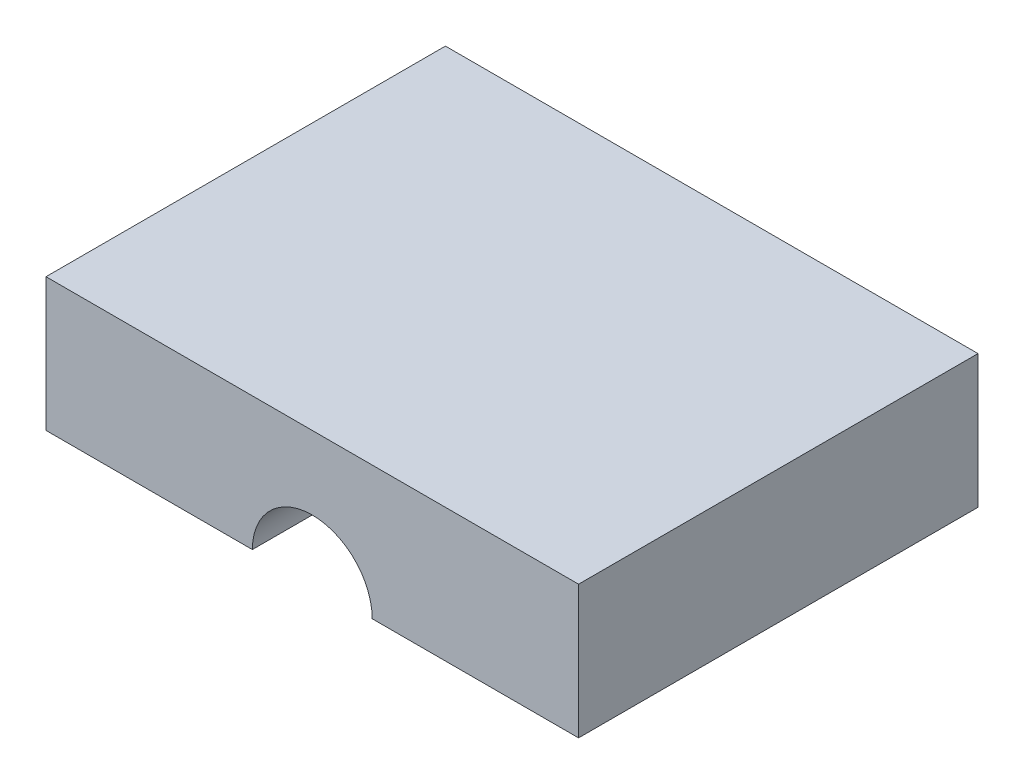
ISO-10303-21;
HEADER;
FILE_DESCRIPTION(('STEP AP214'),'2;1');
FILE_NAME('part.step','',(''),(''),'','','');
FILE_SCHEMA(('AUTOMOTIVE_DESIGN { 1 0 10303 214 1 1 1 1 }'));
ENDSEC;
DATA;
#1=APPLICATION_CONTEXT('core data for automotive mechanical design processes');
#2=APPLICATION_PROTOCOL_DEFINITION('international standard','automotive_design',2000,#1);
#3=PRODUCT_CONTEXT('',#1,'mechanical');
#4=PRODUCT('Part','Part','',(#3));
#5=PRODUCT_RELATED_PRODUCT_CATEGORY('part','',(#4));
#6=PRODUCT_DEFINITION_FORMATION('','',#4);
#7=PRODUCT_DEFINITION_CONTEXT('part definition',#1,'design');
#8=PRODUCT_DEFINITION('design','',#6,#7);
#9=PRODUCT_DEFINITION_SHAPE('','',#8);
#10=(LENGTH_UNIT() NAMED_UNIT(*) SI_UNIT(.MILLI.,.METRE.));
#11=(NAMED_UNIT(*) PLANE_ANGLE_UNIT() SI_UNIT($,.RADIAN.));
#12=(NAMED_UNIT(*) SI_UNIT($,.STERADIAN.) SOLID_ANGLE_UNIT());
#13=UNCERTAINTY_MEASURE_WITH_UNIT(LENGTH_MEASURE(1.E-05),#10,'distance_accuracy_value','');
#14=(GEOMETRIC_REPRESENTATION_CONTEXT(3) GLOBAL_UNCERTAINTY_ASSIGNED_CONTEXT((#13)) GLOBAL_UNIT_ASSIGNED_CONTEXT((#10,
#11,#12)) REPRESENTATION_CONTEXT('',''));
#15=CARTESIAN_POINT('',(0.,0.,0.));
#16=DIRECTION('',(0.,0.,1.));
#17=DIRECTION('',(1.,0.,0.));
#18=AXIS2_PLACEMENT_3D('',#15,#16,#17);
#19=CARTESIAN_POINT('',(0.,0.,0.));
#20=DIRECTION('',(0.,0.,1.));
#21=DIRECTION('',(1.,0.,0.));
#22=AXIS2_PLACEMENT_3D('',#19,#20,#21);
#23=PLANE('',#22);
#24=DIRECTION('',(0.,1.,0.));
#25=VECTOR('',#24,1.);
#26=CARTESIAN_POINT('',(-30.,-15.,0.));
#27=LINE('',#26,#25);
#28=CARTESIAN_POINT('',(-30.,-15.,0.));
#29=VERTEX_POINT('',#28);
#30=CARTESIAN_POINT('',(-30.,-5.00000000000003,0.));
#31=VERTEX_POINT('',#30);
#32=EDGE_CURVE('E111',#29,#31,#27,.T.);
#33=ORIENTED_EDGE('',*,*,#32,.T.);
#34=DIRECTION('',(-1.,0.,0.));
#35=VECTOR('',#34,1.);
#36=CARTESIAN_POINT('',(10.,-5.00000000000003,0.));
#37=LINE('',#36,#35);
#38=CARTESIAN_POINT('',(10.,-5.00000000000003,0.));
#39=VERTEX_POINT('',#38);
#40=EDGE_CURVE('E94',#39,#31,#37,.T.);
#41=ORIENTED_EDGE('',*,*,#40,.F.);
#42=DIRECTION('',(0.,1.,0.));
#43=VECTOR('',#42,1.);
#44=CARTESIAN_POINT('',(10.,-15.,0.));
#45=LINE('',#44,#43);
#46=CARTESIAN_POINT('',(10.,-15.,0.));
#47=VERTEX_POINT('',#46);
#48=EDGE_CURVE('E107',#47,#39,#45,.T.);
#49=ORIENTED_EDGE('',*,*,#48,.F.);
#50=DIRECTION('',(1.,0.,0.));
#51=VECTOR('',#50,1.);
#52=CARTESIAN_POINT('',(10.,-15.,0.));
#53=LINE('',#52,#51);
#54=CARTESIAN_POINT('',(-5.5,-15.,0.));
#55=VERTEX_POINT('',#54);
#56=EDGE_CURVE('E60',#55,#47,#53,.T.);
#57=ORIENTED_EDGE('',*,*,#56,.F.);
#58=CARTESIAN_POINT('',(-10.,-15.,0.));
#59=DIRECTION('',(0.,0.,-1.));
#60=DIRECTION('',(-1.,0.,0.));
#61=AXIS2_PLACEMENT_3D('',#58,#59,#60);
#62=CIRCLE('',#61,4.5);
#63=CARTESIAN_POINT('',(-14.5,-15.,0.));
#64=VERTEX_POINT('',#63);
#65=EDGE_CURVE('E53',#64,#55,#62,.T.);
#66=ORIENTED_EDGE('',*,*,#65,.F.);
#67=EDGE_CURVE('E117',#29,#64,#53,.T.);
#68=ORIENTED_EDGE('',*,*,#67,.F.);
#69=EDGE_LOOP('',(#33,#41,#49,#57,#66,#68));
#70=FACE_BOUND('',#69,.T.);
#71=ADVANCED_FACE('F39',(#70),#23,.F.);
#72=CARTESIAN_POINT('',(10.,-15.,30.));
#73=DIRECTION('',(0.,0.,-1.));
#74=DIRECTION('',(-1.,0.,0.));
#75=AXIS2_PLACEMENT_3D('',#72,#73,#74);
#76=PLANE('',#75);
#77=DIRECTION('',(0.,1.,0.));
#78=VECTOR('',#77,1.);
#79=CARTESIAN_POINT('',(10.,-15.,30.));
#80=LINE('',#79,#78);
#81=CARTESIAN_POINT('',(10.,-15.,30.));
#82=VERTEX_POINT('',#81);
#83=CARTESIAN_POINT('',(10.,-5.00000000000003,30.));
#84=VERTEX_POINT('',#83);
#85=EDGE_CURVE('E130',#82,#84,#80,.T.);
#86=ORIENTED_EDGE('',*,*,#85,.T.);
#87=DIRECTION('',(-1.,0.,0.));
#88=VECTOR('',#87,1.);
#89=CARTESIAN_POINT('',(10.,-5.00000000000004,30.));
#90=LINE('',#89,#88);
#91=CARTESIAN_POINT('',(-30.,-5.00000000000003,30.));
#92=VERTEX_POINT('',#91);
#93=EDGE_CURVE('E97',#84,#92,#90,.T.);
#94=ORIENTED_EDGE('',*,*,#93,.T.);
#95=DIRECTION('',(0.,1.,0.));
#96=VECTOR('',#95,1.);
#97=CARTESIAN_POINT('',(-30.,-15.,30.));
#98=LINE('',#97,#96);
#99=CARTESIAN_POINT('',(-30.,-15.,30.));
#100=VERTEX_POINT('',#99);
#101=EDGE_CURVE('E121',#100,#92,#98,.T.);
#102=ORIENTED_EDGE('',*,*,#101,.F.);
#103=DIRECTION('',(-1.,0.,0.));
#104=VECTOR('',#103,1.);
#105=CARTESIAN_POINT('',(10.,-15.,30.));
#106=LINE('',#105,#104);
#107=CARTESIAN_POINT('',(-14.5,-15.,30.));
#108=VERTEX_POINT('',#107);
#109=EDGE_CURVE('E143',#108,#100,#106,.T.);
#110=ORIENTED_EDGE('',*,*,#109,.F.);
#111=CARTESIAN_POINT('',(-10.,-15.,30.));
#112=DIRECTION('',(0.,0.,-1.));
#113=DIRECTION('',(-1.,0.,0.));
#114=AXIS2_PLACEMENT_3D('',#111,#112,#113);
#115=CIRCLE('',#114,4.5);
#116=CARTESIAN_POINT('',(-5.5,-15.,30.));
#117=VERTEX_POINT('',#116);
#118=EDGE_CURVE('E135',#108,#117,#115,.T.);
#119=ORIENTED_EDGE('',*,*,#118,.T.);
#120=EDGE_CURVE('E141',#82,#117,#106,.T.);
#121=ORIENTED_EDGE('',*,*,#120,.F.);
#122=EDGE_LOOP('',(#86,#94,#102,#110,#119,#121));
#123=FACE_BOUND('',#122,.T.);
#124=ADVANCED_FACE('F140',(#123),#76,.F.);
#125=CARTESIAN_POINT('',(0.,-15.,0.));
#126=DIRECTION('',(0.,-1.,0.));
#127=DIRECTION('',(0.,0.,-1.));
#128=AXIS2_PLACEMENT_3D('',#125,#126,#127);
#129=PLANE('',#128);
#130=DIRECTION('',(0.,0.,-1.));
#131=VECTOR('',#130,1.);
#132=CARTESIAN_POINT('',(-14.5,-15.,55.));
#133=LINE('',#132,#131);
#134=EDGE_CURVE('E12',#108,#64,#133,.T.);
#135=ORIENTED_EDGE('',*,*,#134,.F.);
#136=ORIENTED_EDGE('',*,*,#109,.T.);
#137=DIRECTION('',(0.,0.,-1.));
#138=VECTOR('',#137,1.);
#139=CARTESIAN_POINT('',(-30.,-15.,0.));
#140=LINE('',#139,#138);
#141=EDGE_CURVE('E148',#100,#29,#140,.T.);
#142=ORIENTED_EDGE('',*,*,#141,.T.);
#143=ORIENTED_EDGE('',*,*,#67,.T.);
#144=EDGE_LOOP('',(#135,#136,#142,#143));
#145=FACE_BOUND('',#144,.T.);
#146=ADVANCED_FACE('F164',(#145),#129,.T.);
#147=CARTESIAN_POINT('',(10.,-15.,0.));
#148=DIRECTION('',(-1.,0.,0.));
#149=DIRECTION('',(0.,0.,1.));
#150=AXIS2_PLACEMENT_3D('',#147,#148,#149);
#151=PLANE('',#150);
#152=ORIENTED_EDGE('',*,*,#48,.T.);
#153=DIRECTION('',(0.,0.,-1.));
#154=VECTOR('',#153,1.);
#155=CARTESIAN_POINT('',(10.,-5.00000000000003,55.));
#156=LINE('',#155,#154);
#157=EDGE_CURVE('E91',#84,#39,#156,.T.);
#158=ORIENTED_EDGE('',*,*,#157,.F.);
#159=ORIENTED_EDGE('',*,*,#85,.F.);
#160=DIRECTION('',(0.,0.,1.));
#161=VECTOR('',#160,1.);
#162=CARTESIAN_POINT('',(10.,-15.,0.));
#163=LINE('',#162,#161);
#164=EDGE_CURVE('E115',#47,#82,#163,.T.);
#165=ORIENTED_EDGE('',*,*,#164,.F.);
#166=EDGE_LOOP('',(#152,#158,#159,#165));
#167=FACE_BOUND('',#166,.T.);
#168=ADVANCED_FACE('F114',(#167),#151,.F.);
#169=CARTESIAN_POINT('',(-30.,-15.,0.));
#170=DIRECTION('',(1.,0.,0.));
#171=DIRECTION('',(0.,0.,-1.));
#172=AXIS2_PLACEMENT_3D('',#169,#170,#171);
#173=PLANE('',#172);
#174=ORIENTED_EDGE('',*,*,#101,.T.);
#175=DIRECTION('',(0.,0.,-1.));
#176=VECTOR('',#175,1.);
#177=CARTESIAN_POINT('',(-30.,-5.00000000000003,55.));
#178=LINE('',#177,#176);
#179=EDGE_CURVE('E103',#92,#31,#178,.T.);
#180=ORIENTED_EDGE('',*,*,#179,.T.);
#181=ORIENTED_EDGE('',*,*,#32,.F.);
#182=ORIENTED_EDGE('',*,*,#141,.F.);
#183=EDGE_LOOP('',(#174,#180,#181,#182));
#184=FACE_BOUND('',#183,.T.);
#185=ADVANCED_FACE('F162',(#184),#173,.F.);
#186=DIRECTION('',(0.,0.,-1.));
#187=VECTOR('',#186,1.);
#188=CARTESIAN_POINT('',(-5.5,-15.,55.));
#189=LINE('',#188,#187);
#190=EDGE_CURVE('E47',#55,#117,#189,.F.);
#191=ORIENTED_EDGE('',*,*,#190,.F.);
#192=ORIENTED_EDGE('',*,*,#56,.T.);
#193=ORIENTED_EDGE('',*,*,#164,.T.);
#194=ORIENTED_EDGE('',*,*,#120,.T.);
#195=EDGE_LOOP('',(#191,#192,#193,#194));
#196=FACE_BOUND('',#195,.T.);
#197=ADVANCED_FACE('F146',(#196),#129,.T.);
#198=CARTESIAN_POINT('',(-10.,-15.,55.));
#199=DIRECTION('',(0.,0.,-1.));
#200=DIRECTION('',(-1.,0.,0.));
#201=AXIS2_PLACEMENT_3D('',#198,#199,#200);
#202=CYLINDRICAL_SURFACE('',#201,4.5);
#203=ORIENTED_EDGE('',*,*,#134,.T.);
#204=ORIENTED_EDGE('',*,*,#65,.T.);
#205=ORIENTED_EDGE('',*,*,#190,.T.);
#206=ORIENTED_EDGE('',*,*,#118,.F.);
#207=EDGE_LOOP('',(#203,#204,#205,#206));
#208=FACE_BOUND('',#207,.T.);
#209=ADVANCED_FACE('F134',(#208),#202,.F.);
#210=CARTESIAN_POINT('',(10.,-5.00000000000003,55.));
#211=DIRECTION('',(0.,-1.,0.));
#212=DIRECTION('',(0.,0.,-1.));
#213=AXIS2_PLACEMENT_3D('',#210,#211,#212);
#214=PLANE('',#213);
#215=ORIENTED_EDGE('',*,*,#157,.T.);
#216=ORIENTED_EDGE('',*,*,#40,.T.);
#217=ORIENTED_EDGE('',*,*,#179,.F.);
#218=ORIENTED_EDGE('',*,*,#93,.F.);
#219=EDGE_LOOP('',(#215,#216,#217,#218));
#220=FACE_BOUND('',#219,.T.);
#221=ADVANCED_FACE('F93',(#220),#214,.F.);
#222=CLOSED_SHELL('',(#71,#124,#146,#168,#185,#197,#209,#221));
#223=MANIFOLD_SOLID_BREP('B2',#222);
#224=ADVANCED_BREP_SHAPE_REPRESENTATION('',(#18,#223),#14);
#225=SHAPE_DEFINITION_REPRESENTATION(#9,#224);
ENDSEC;
END-ISO-10303-21;
